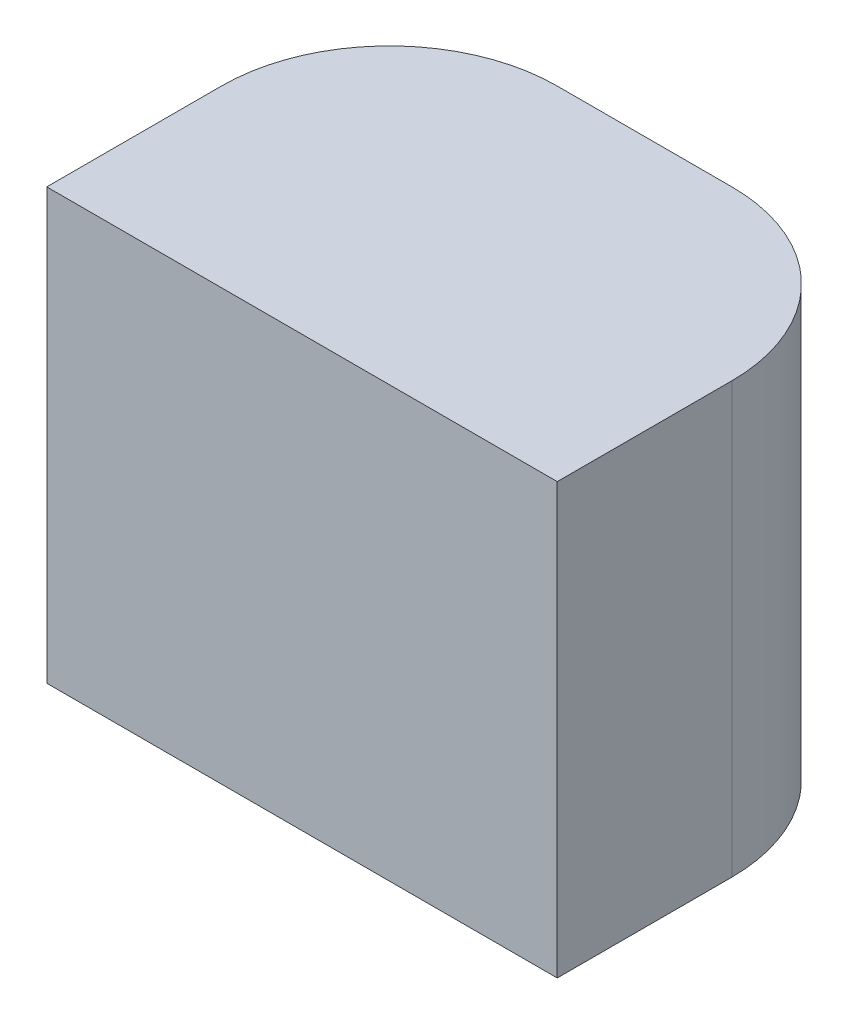
ISO-10303-21;
HEADER;
FILE_DESCRIPTION(('STEP AP214'),'2;1');
FILE_NAME('part.step','',(''),(''),'','','');
FILE_SCHEMA(('AUTOMOTIVE_DESIGN { 1 0 10303 214 1 1 1 1 }'));
ENDSEC;
DATA;
#1=APPLICATION_CONTEXT('core data for automotive mechanical design processes');
#2=APPLICATION_PROTOCOL_DEFINITION('international standard','automotive_design',2000,#1);
#3=PRODUCT_CONTEXT('',#1,'mechanical');
#4=PRODUCT('Part','Part','',(#3));
#5=PRODUCT_RELATED_PRODUCT_CATEGORY('part','',(#4));
#6=PRODUCT_DEFINITION_FORMATION('','',#4);
#7=PRODUCT_DEFINITION_CONTEXT('part definition',#1,'design');
#8=PRODUCT_DEFINITION('design','',#6,#7);
#9=PRODUCT_DEFINITION_SHAPE('','',#8);
#10=(LENGTH_UNIT() NAMED_UNIT(*) SI_UNIT(.MILLI.,.METRE.));
#11=(NAMED_UNIT(*) PLANE_ANGLE_UNIT() SI_UNIT($,.RADIAN.));
#12=(NAMED_UNIT(*) SI_UNIT($,.STERADIAN.) SOLID_ANGLE_UNIT());
#13=UNCERTAINTY_MEASURE_WITH_UNIT(LENGTH_MEASURE(1.E-05),#10,'distance_accuracy_value','');
#14=(GEOMETRIC_REPRESENTATION_CONTEXT(3) GLOBAL_UNCERTAINTY_ASSIGNED_CONTEXT((#13)) GLOBAL_UNIT_ASSIGNED_CONTEXT((#10,
#11,#12)) REPRESENTATION_CONTEXT('',''));
#15=CARTESIAN_POINT('',(0.,0.,0.));
#16=DIRECTION('',(0.,0.,1.));
#17=DIRECTION('',(1.,0.,0.));
#18=AXIS2_PLACEMENT_3D('',#15,#16,#17);
#19=CARTESIAN_POINT('',(1.14,0.,-1.655));
#20=DIRECTION('',(0.,-1.,0.));
#21=DIRECTION('',(0.,0.,-1.));
#22=AXIS2_PLACEMENT_3D('',#19,#20,#21);
#23=CYLINDRICAL_SURFACE('',#22,0.25);
#24=CARTESIAN_POINT('',(1.14,-0.64,-1.655));
#25=DIRECTION('',(0.,-1.,0.));
#26=DIRECTION('',(0.,0.,1.));
#27=AXIS2_PLACEMENT_3D('',#24,#25,#26);
#28=CIRCLE('',#27,0.25);
#29=CARTESIAN_POINT('',(0.89,-0.64,-1.655));
#30=VERTEX_POINT('',#29);
#31=CARTESIAN_POINT('',(1.14,-0.64,-1.905));
#32=VERTEX_POINT('',#31);
#33=EDGE_CURVE('E11',#30,#32,#28,.T.);
#34=ORIENTED_EDGE('',*,*,#33,.F.);
#35=DIRECTION('',(0.,-1.,0.));
#36=VECTOR('',#35,1.);
#37=CARTESIAN_POINT('',(0.89,0.,-1.655));
#38=LINE('',#37,#36);
#39=CARTESIAN_POINT('',(0.89,0.,-1.655));
#40=VERTEX_POINT('',#39);
#41=EDGE_CURVE('E24',#40,#30,#38,.T.);
#42=ORIENTED_EDGE('',*,*,#41,.F.);
#43=CARTESIAN_POINT('',(1.14,0.,-1.655));
#44=DIRECTION('',(0.,-1.,0.));
#45=DIRECTION('',(0.,0.,1.));
#46=AXIS2_PLACEMENT_3D('',#43,#44,#45);
#47=CIRCLE('',#46,0.25);
#48=CARTESIAN_POINT('',(1.14,0.,-1.905));
#49=VERTEX_POINT('',#48);
#50=EDGE_CURVE('E119',#40,#49,#47,.T.);
#51=ORIENTED_EDGE('',*,*,#50,.T.);
#52=DIRECTION('',(0.,-1.,0.));
#53=VECTOR('',#52,1.);
#54=CARTESIAN_POINT('',(1.14,0.,-1.905));
#55=LINE('',#54,#53);
#56=EDGE_CURVE('E90',#49,#32,#55,.T.);
#57=ORIENTED_EDGE('',*,*,#56,.T.);
#58=EDGE_LOOP('',(#34,#42,#51,#57));
#59=FACE_BOUND('',#58,.T.);
#60=ADVANCED_FACE('F17',(#59),#23,.T.);
#61=CARTESIAN_POINT('',(0.88999999999999,0.,-1.395));
#62=DIRECTION('',(-1.,0.,0.));
#63=DIRECTION('',(0.,0.,1.));
#64=AXIS2_PLACEMENT_3D('',#61,#62,#63);
#65=PLANE('',#64);
#66=DIRECTION('',(0.,0.,-1.));
#67=VECTOR('',#66,1.);
#68=CARTESIAN_POINT('',(0.88999999999999,-0.64,-1.395));
#69=LINE('',#68,#67);
#70=CARTESIAN_POINT('',(0.88999999999999,-0.64,-1.395));
#71=VERTEX_POINT('',#70);
#72=EDGE_CURVE('E116',#71,#30,#69,.T.);
#73=ORIENTED_EDGE('',*,*,#72,.F.);
#74=DIRECTION('',(0.,-1.,0.));
#75=VECTOR('',#74,1.);
#76=CARTESIAN_POINT('',(0.88999999999999,0.,-1.395));
#77=LINE('',#76,#75);
#78=CARTESIAN_POINT('',(0.88999999999999,0.,-1.395));
#79=VERTEX_POINT('',#78);
#80=EDGE_CURVE('E113',#79,#71,#77,.T.);
#81=ORIENTED_EDGE('',*,*,#80,.F.);
#82=DIRECTION('',(0.,0.,-1.));
#83=VECTOR('',#82,1.);
#84=CARTESIAN_POINT('',(0.88999999999999,0.,-1.395));
#85=LINE('',#84,#83);
#86=EDGE_CURVE('E110',#79,#40,#85,.T.);
#87=ORIENTED_EDGE('',*,*,#86,.T.);
#88=ORIENTED_EDGE('',*,*,#41,.T.);
#89=EDGE_LOOP('',(#73,#81,#87,#88));
#90=FACE_BOUND('',#89,.T.);
#91=ADVANCED_FACE('F121',(#90),#65,.T.);
#92=CARTESIAN_POINT('',(1.65,0.,-1.395));
#93=DIRECTION('',(0.,0.,1.));
#94=DIRECTION('',(1.,0.,0.));
#95=AXIS2_PLACEMENT_3D('',#92,#93,#94);
#96=PLANE('',#95);
#97=DIRECTION('',(-1.,0.,0.));
#98=VECTOR('',#97,1.);
#99=CARTESIAN_POINT('',(1.65,-0.64,-1.395));
#100=LINE('',#99,#98);
#101=CARTESIAN_POINT('',(1.65,-0.64,-1.395));
#102=VERTEX_POINT('',#101);
#103=EDGE_CURVE('E107',#102,#71,#100,.T.);
#104=ORIENTED_EDGE('',*,*,#103,.F.);
#105=DIRECTION('',(0.,-1.,0.));
#106=VECTOR('',#105,1.);
#107=CARTESIAN_POINT('',(1.65,0.,-1.395));
#108=LINE('',#107,#106);
#109=CARTESIAN_POINT('',(1.65,0.,-1.395));
#110=VERTEX_POINT('',#109);
#111=EDGE_CURVE('E104',#110,#102,#108,.T.);
#112=ORIENTED_EDGE('',*,*,#111,.F.);
#113=DIRECTION('',(-1.,0.,0.));
#114=VECTOR('',#113,1.);
#115=CARTESIAN_POINT('',(1.65,0.,-1.395));
#116=LINE('',#115,#114);
#117=EDGE_CURVE('E101',#110,#79,#116,.T.);
#118=ORIENTED_EDGE('',*,*,#117,.T.);
#119=ORIENTED_EDGE('',*,*,#80,.T.);
#120=EDGE_LOOP('',(#104,#112,#118,#119));
#121=FACE_BOUND('',#120,.T.);
#122=ADVANCED_FACE('F125',(#121),#96,.T.);
#123=CARTESIAN_POINT('',(1.65,0.,-1.395));
#124=DIRECTION('',(1.,0.,0.));
#125=DIRECTION('',(0.,0.,-1.));
#126=AXIS2_PLACEMENT_3D('',#123,#124,#125);
#127=PLANE('',#126);
#128=DIRECTION('',(0.,0.,1.));
#129=VECTOR('',#128,1.);
#130=CARTESIAN_POINT('',(1.65,-0.64,-1.395));
#131=LINE('',#130,#129);
#132=CARTESIAN_POINT('',(1.65,-0.64,-1.655));
#133=VERTEX_POINT('',#132);
#134=EDGE_CURVE('E98',#133,#102,#131,.T.);
#135=ORIENTED_EDGE('',*,*,#134,.F.);
#136=DIRECTION('',(0.,-1.,0.));
#137=VECTOR('',#136,1.);
#138=CARTESIAN_POINT('',(1.65,0.,-1.655));
#139=LINE('',#138,#137);
#140=CARTESIAN_POINT('',(1.65,0.,-1.655));
#141=VERTEX_POINT('',#140);
#142=EDGE_CURVE('E96',#141,#133,#139,.T.);
#143=ORIENTED_EDGE('',*,*,#142,.F.);
#144=DIRECTION('',(0.,0.,1.));
#145=VECTOR('',#144,1.);
#146=CARTESIAN_POINT('',(1.65,0.,-1.395));
#147=LINE('',#146,#145);
#148=EDGE_CURVE('E85',#141,#110,#147,.T.);
#149=ORIENTED_EDGE('',*,*,#148,.T.);
#150=ORIENTED_EDGE('',*,*,#111,.T.);
#151=EDGE_LOOP('',(#135,#143,#149,#150));
#152=FACE_BOUND('',#151,.T.);
#153=ADVANCED_FACE('F127',(#152),#127,.T.);
#154=CARTESIAN_POINT('',(1.4,0.,-1.655));
#155=DIRECTION('',(0.,-1.,0.));
#156=DIRECTION('',(0.,0.,-1.));
#157=AXIS2_PLACEMENT_3D('',#154,#155,#156);
#158=CYLINDRICAL_SURFACE('',#157,0.25);
#159=CARTESIAN_POINT('',(1.4,-0.64,-1.655));
#160=DIRECTION('',(0.,-1.,0.));
#161=DIRECTION('',(0.,0.,1.));
#162=AXIS2_PLACEMENT_3D('',#159,#160,#161);
#163=CIRCLE('',#162,0.25);
#164=CARTESIAN_POINT('',(1.4,-0.64,-1.905));
#165=VERTEX_POINT('',#164);
#166=EDGE_CURVE('E72',#165,#133,#163,.T.);
#167=ORIENTED_EDGE('',*,*,#166,.F.);
#168=DIRECTION('',(0.,-1.,0.));
#169=VECTOR('',#168,1.);
#170=CARTESIAN_POINT('',(1.4,0.,-1.905));
#171=LINE('',#170,#169);
#172=CARTESIAN_POINT('',(1.4,0.,-1.905));
#173=VERTEX_POINT('',#172);
#174=EDGE_CURVE('E66',#173,#165,#171,.T.);
#175=ORIENTED_EDGE('',*,*,#174,.F.);
#176=CARTESIAN_POINT('',(1.4,0.,-1.655));
#177=DIRECTION('',(0.,-1.,0.));
#178=DIRECTION('',(0.,0.,1.));
#179=AXIS2_PLACEMENT_3D('',#176,#177,#178);
#180=CIRCLE('',#179,0.25);
#181=EDGE_CURVE('E70',#173,#141,#180,.T.);
#182=ORIENTED_EDGE('',*,*,#181,.T.);
#183=ORIENTED_EDGE('',*,*,#142,.T.);
#184=EDGE_LOOP('',(#167,#175,#182,#183));
#185=FACE_BOUND('',#184,.T.);
#186=ADVANCED_FACE('F68',(#185),#158,.T.);
#187=CARTESIAN_POINT('',(1.4,0.,-1.905));
#188=DIRECTION('',(0.,0.,-1.));
#189=DIRECTION('',(-1.,0.,0.));
#190=AXIS2_PLACEMENT_3D('',#187,#188,#189);
#191=PLANE('',#190);
#192=DIRECTION('',(1.,0.,0.));
#193=VECTOR('',#192,1.);
#194=CARTESIAN_POINT('',(1.4,-0.64,-1.905));
#195=LINE('',#194,#193);
#196=EDGE_CURVE('E86',#32,#165,#195,.T.);
#197=ORIENTED_EDGE('',*,*,#196,.F.);
#198=ORIENTED_EDGE('',*,*,#56,.F.);
#199=DIRECTION('',(1.,0.,0.));
#200=VECTOR('',#199,1.);
#201=CARTESIAN_POINT('',(1.4,0.,-1.905));
#202=LINE('',#201,#200);
#203=EDGE_CURVE('E82',#49,#173,#202,.T.);
#204=ORIENTED_EDGE('',*,*,#203,.T.);
#205=ORIENTED_EDGE('',*,*,#174,.T.);
#206=EDGE_LOOP('',(#197,#198,#204,#205));
#207=FACE_BOUND('',#206,.T.);
#208=ADVANCED_FACE('F89',(#207),#191,.T.);
#209=CARTESIAN_POINT('',(1.14,0.,-1.655));
#210=DIRECTION('',(0.,1.,0.));
#211=DIRECTION('',(0.,0.,1.));
#212=AXIS2_PLACEMENT_3D('',#209,#210,#211);
#213=PLANE('',#212);
#214=ORIENTED_EDGE('',*,*,#50,.F.);
#215=ORIENTED_EDGE('',*,*,#86,.F.);
#216=ORIENTED_EDGE('',*,*,#117,.F.);
#217=ORIENTED_EDGE('',*,*,#148,.F.);
#218=ORIENTED_EDGE('',*,*,#181,.F.);
#219=ORIENTED_EDGE('',*,*,#203,.F.);
#220=EDGE_LOOP('',(#214,#215,#216,#217,#218,#219));
#221=FACE_BOUND('',#220,.T.);
#222=ADVANCED_FACE('F81',(#221),#213,.T.);
#223=CARTESIAN_POINT('',(1.14,-0.64,-1.655));
#224=DIRECTION('',(0.,1.,0.));
#225=DIRECTION('',(0.,0.,1.));
#226=AXIS2_PLACEMENT_3D('',#223,#224,#225);
#227=PLANE('',#226);
#228=ORIENTED_EDGE('',*,*,#33,.T.);
#229=ORIENTED_EDGE('',*,*,#196,.T.);
#230=ORIENTED_EDGE('',*,*,#166,.T.);
#231=ORIENTED_EDGE('',*,*,#134,.T.);
#232=ORIENTED_EDGE('',*,*,#103,.T.);
#233=ORIENTED_EDGE('',*,*,#72,.T.);
#234=EDGE_LOOP('',(#228,#229,#230,#231,#232,#233));
#235=FACE_BOUND('',#234,.T.);
#236=ADVANCED_FACE('F123',(#235),#227,.F.);
#237=CLOSED_SHELL('',(#60,#91,#122,#153,#186,#208,#222,#236));
#238=MANIFOLD_SOLID_BREP('B1',#237);
#239=ADVANCED_BREP_SHAPE_REPRESENTATION('',(#18,#238),#14);
#240=SHAPE_DEFINITION_REPRESENTATION(#9,#239);
ENDSEC;
END-ISO-10303-21;
